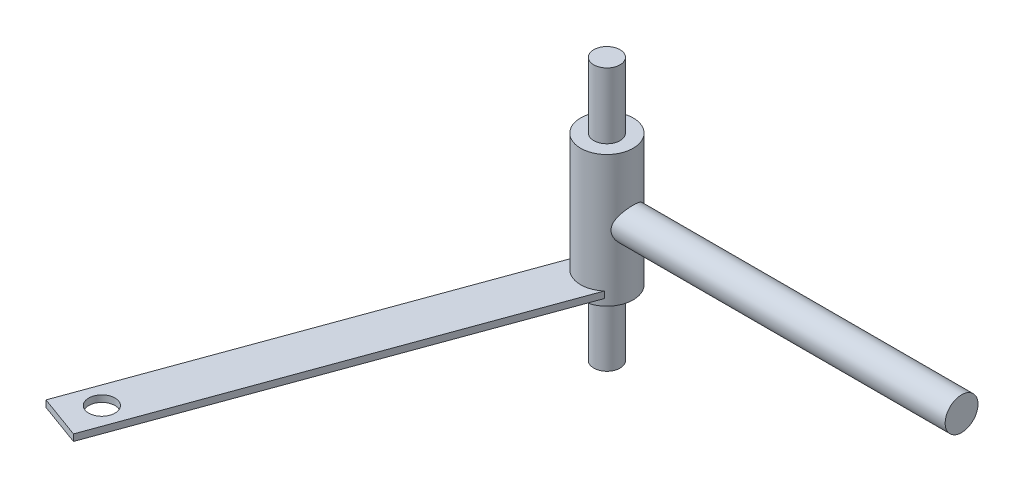
ISO-10303-21;
HEADER;
FILE_DESCRIPTION(('STEP AP214'),'2;1');
FILE_NAME('part.step','',(''),(''),'','','');
FILE_SCHEMA(('AUTOMOTIVE_DESIGN { 1 0 10303 214 1 1 1 1 }'));
ENDSEC;
DATA;
#1=APPLICATION_CONTEXT('core data for automotive mechanical design processes');
#2=APPLICATION_PROTOCOL_DEFINITION('international standard','automotive_design',2000,#1);
#3=PRODUCT_CONTEXT('',#1,'mechanical');
#4=PRODUCT('Part','Part','',(#3));
#5=PRODUCT_RELATED_PRODUCT_CATEGORY('part','',(#4));
#6=PRODUCT_DEFINITION_FORMATION('','',#4);
#7=PRODUCT_DEFINITION_CONTEXT('part definition',#1,'design');
#8=PRODUCT_DEFINITION('design','',#6,#7);
#9=PRODUCT_DEFINITION_SHAPE('','',#8);
#10=(LENGTH_UNIT() NAMED_UNIT(*) SI_UNIT(.MILLI.,.METRE.));
#11=(NAMED_UNIT(*) PLANE_ANGLE_UNIT() SI_UNIT($,.RADIAN.));
#12=(NAMED_UNIT(*) SI_UNIT($,.STERADIAN.) SOLID_ANGLE_UNIT());
#13=UNCERTAINTY_MEASURE_WITH_UNIT(LENGTH_MEASURE(1.E-05),#10,'distance_accuracy_value','');
#14=(GEOMETRIC_REPRESENTATION_CONTEXT(3) GLOBAL_UNCERTAINTY_ASSIGNED_CONTEXT((#13)) GLOBAL_UNIT_ASSIGNED_CONTEXT((#10,
#11,#12)) REPRESENTATION_CONTEXT('',''));
#15=CARTESIAN_POINT('',(0.,0.,0.));
#16=DIRECTION('',(0.,0.,1.));
#17=DIRECTION('',(1.,0.,0.));
#18=AXIS2_PLACEMENT_3D('',#15,#16,#17);
#19=CARTESIAN_POINT('',(0.,20.,0.));
#20=DIRECTION('',(0.,-1.,0.));
#21=DIRECTION('',(0.,0.,-1.));
#22=AXIS2_PLACEMENT_3D('',#19,#20,#21);
#23=CYLINDRICAL_SURFACE('',#22,8.);
#24=CARTESIAN_POINT('',(6.2449979983984,0.,5.));
#25=CARTESIAN_POINT('',(6.24499999083318,-0.124309997084916,4.99999874728376));
#26=CARTESIAN_POINT('',(6.24872594235153,-0.248643911922182,4.99535477639502));
#27=CARTESIAN_POINT('',(6.26346233698878,-0.49624234521784,4.97686385741702));
#28=CARTESIAN_POINT('',(6.27447707053879,-0.619506190474289,4.96301148892208));
#29=CARTESIAN_POINT('',(6.30332817855701,-0.864132894108489,4.92631685582622));
#30=CARTESIAN_POINT('',(6.32117831167981,-0.985491401070756,4.90345645667282));
#31=CARTESIAN_POINT('',(6.36295500797281,-1.22521846002732,4.84912073775945));
#32=CARTESIAN_POINT('',(6.38688460836052,-1.34358548492504,4.81764111134031));
#33=CARTESIAN_POINT('',(6.46598710467671,-1.69098285176997,4.7115563432738));
#34=CARTESIAN_POINT('',(6.52878844336903,-1.91472159134201,4.6249307188155));
#35=CARTESIAN_POINT('',(6.66732308206754,-2.34407629105235,4.42286683667302));
#36=CARTESIAN_POINT('',(6.74305673480881,-2.54969175663766,4.30742779304936));
#37=CARTESIAN_POINT('',(6.91118002626909,-2.9674414130167,4.03296948836377));
#38=CARTESIAN_POINT('',(7.00444112628932,-3.17674952950574,3.87018134056582));
#39=CARTESIAN_POINT('',(7.19012524520994,-3.5675602565304,3.51319765959103));
#40=CARTESIAN_POINT('',(7.28254746874407,-3.74903864049325,3.31897506071619));
#41=CARTESIAN_POINT('',(7.41988971846401,-4.00760626149244,2.99356128179164));
#42=CARTESIAN_POINT('',(7.46785190700925,-4.09554829341698,2.87212880091628));
#43=CARTESIAN_POINT('',(7.55971876275306,-4.2607595171728,2.62078661715024));
#44=CARTESIAN_POINT('',(7.60362512973126,-4.33803318685166,2.49088050482952));
#45=CARTESIAN_POINT('',(7.68611478127736,-4.48104536831486,2.22333771815377));
#46=CARTESIAN_POINT('',(7.72470066932016,-4.54678952615798,2.08570487145723));
#47=CARTESIAN_POINT('',(7.79539753077303,-4.66588913640084,1.80358193532003));
#48=CARTESIAN_POINT('',(7.82750968154027,-4.71924684175159,1.6590930986712));
#49=CARTESIAN_POINT('',(7.88132879110577,-4.8079574186921,1.37943032429723));
#50=CARTESIAN_POINT('',(7.90376135583819,-4.84458864196752,1.24480106420069));
#51=CARTESIAN_POINT('',(7.94191844310852,-4.90659427549434,0.972050692903698));
#52=CARTESIAN_POINT('',(7.95764407963578,-4.93197055516711,0.833930165626438));
#53=CARTESIAN_POINT('',(7.98191012055643,-4.97102838824165,0.555534462309618));
#54=CARTESIAN_POINT('',(7.9904564434862,-4.98471957483722,0.415261158337185));
#55=CARTESIAN_POINT('',(8.00011955525847,-5.00019508535282,0.133810084943768));
#56=CARTESIAN_POINT('',(8.00123719925945,-5.00198077978344,-0.00736757849820934));
#57=CARTESIAN_POINT('',(7.99636544353032,-4.99418306842006,-0.270239609899376));
#58=CARTESIAN_POINT('',(7.99131217584322,-4.9860972278415,-0.391999310072934));
#59=CARTESIAN_POINT('',(7.97573898833036,-4.96109950689231,-0.63429359230614));
#60=CARTESIAN_POINT('',(7.96521743178982,-4.94418498400023,-0.754827796543429));
#61=CARTESIAN_POINT('',(7.93894787928476,-4.90175195667388,-0.9937504162903));
#62=CARTESIAN_POINT('',(7.92320165200919,-4.8762363638823,-1.11213954368103));
#63=CARTESIAN_POINT('',(7.88683283084566,-4.81691536004192,-1.34607315554106));
#64=CARTESIAN_POINT('',(7.86620835217571,-4.78310674467799,-1.46161652141072));
#65=CARTESIAN_POINT('',(7.79753837345255,-4.66961406787293,-1.80341623892686));
#66=CARTESIAN_POINT('',(7.74273886956257,-4.57793007291278,-2.02447250488061));
#67=CARTESIAN_POINT('',(7.6194209119633,-4.36611560771666,-2.44811588786114));
#68=CARTESIAN_POINT('',(7.55089933332867,-4.24597865675437,-2.6506987826293));
#69=CARTESIAN_POINT('',(7.39573414184525,-3.96389668023518,-3.05883635403528));
#70=CARTESIAN_POINT('',(7.30789649394851,-3.79860933546551,-3.26162345770391));
#71=CARTESIAN_POINT('',(7.12780216070677,-3.43944259665051,-3.63842034253163));
#72=CARTESIAN_POINT('',(7.0355391870356,-3.24552165003414,-3.81238750882611));
#73=CARTESIAN_POINT('',(6.89398778931581,-2.92199806035766,-4.05999923159469));
#74=CARTESIAN_POINT('',(6.84343529038729,-2.80103153254676,-4.14440430037547));
#75=CARTESIAN_POINT('',(6.7450499014227,-2.5512511400869,-4.30267035241461));
#76=CARTESIAN_POINT('',(6.69721752335299,-2.42243580756731,-4.37652935467605));
#77=CARTESIAN_POINT('',(6.60608014442446,-2.15770926568204,-4.51291782494085));
#78=CARTESIAN_POINT('',(6.56276754252838,-2.02181056536115,-4.57546644816391));
#79=CARTESIAN_POINT('',(6.48238923774268,-1.74330768244433,-4.6886516739402));
#80=CARTESIAN_POINT('',(6.44532349757936,-1.60070353986484,-4.7392883475702));
#81=CARTESIAN_POINT('',(6.3879911088914,-1.34808415551627,-4.81614194168603));
#82=CARTESIAN_POINT('',(6.36587062744548,-1.23937010533179,-4.84527833481626));
#83=CARTESIAN_POINT('',(6.3267200135842,-1.01935900201234,-4.89628944573215));
#84=CARTESIAN_POINT('',(6.30968872571675,-0.908062541381968,-4.91816581196151));
#85=CARTESIAN_POINT('',(6.2813224765214,-0.683654493148006,-4.95434333722363));
#86=CARTESIAN_POINT('',(6.26998098512218,-0.570545140796211,-4.96865318123363));
#87=CARTESIAN_POINT('',(6.25339132178237,-0.343158274667134,-4.98951663397229));
#88=CARTESIAN_POINT('',(6.24814339794355,-0.228880713516906,-4.99606992689043));
#89=CARTESIAN_POINT('',(6.24394563972607,0.000213756327469843,-5.00131530513999));
#90=CARTESIAN_POINT('',(6.2450091194138,0.115031294285455,-4.99999077198392));
#91=CARTESIAN_POINT('',(6.25342323341975,0.34411058983996,-4.98946310366481));
#92=CARTESIAN_POINT('',(6.26077617711313,0.458372127783275,-4.98025707456074));
#93=CARTESIAN_POINT('',(6.28148941326477,0.685492435641885,-4.95410620951325));
#94=CARTESIAN_POINT('',(6.29485173090555,0.798350719467862,-4.9371587646522));
#95=CARTESIAN_POINT('',(6.32708655414446,1.02190368194708,-4.8957794498311));
#96=CARTESIAN_POINT('',(6.3459613393153,1.13259744525952,-4.87134448334739));
#97=CARTESIAN_POINT('',(6.40919739263554,1.45674114316006,-4.78821642821574));
#98=CARTESIAN_POINT('',(6.46057720915498,1.6662777271024,-4.71921780239627));
#99=CARTESIAN_POINT('',(6.57662484324882,2.07118631830434,-4.55609149726001));
#100=CARTESIAN_POINT('',(6.6412973751829,2.26655326684989,-4.46195489902188));
#101=CARTESIAN_POINT('',(6.79148506979738,2.67720575477837,-4.23062377482239));
#102=CARTESIAN_POINT('',(6.87862419429458,2.88920195195314,-4.08864375810928));
#103=CARTESIAN_POINT('',(7.05576916354209,3.28876845285956,-3.77473221644168));
#104=CARTESIAN_POINT('',(7.14577790264,3.47631305761312,-3.60276961587649));
#105=CARTESIAN_POINT('',(7.28444679190235,3.75109437385404,-3.30924585333197));
#106=CARTESIAN_POINT('',(7.3346230901993,3.84742308399405,-3.19677534649598));
#107=CARTESIAN_POINT('',(7.43214539316412,4.03023211498251,-2.96297696798608));
#108=CARTESIAN_POINT('',(7.47949245970999,4.11671614194503,-2.84165245789285));
#109=CARTESIAN_POINT('',(7.57009743381039,4.27912544276188,-2.59064393379972));
#110=CARTESIAN_POINT('',(7.61335451021155,4.35504857193848,-2.46095822963468));
#111=CARTESIAN_POINT('',(7.69452475176042,4.49544110368957,-2.19402109584822));
#112=CARTESIAN_POINT('',(7.73244126265916,4.55991768393769,-2.05677447863483));
#113=CARTESIAN_POINT('',(7.79976180045409,4.67313922374355,-1.78389488579443));
#114=CARTESIAN_POINT('',(7.82953658856128,4.72258893611767,-1.64864631402092));
#115=CARTESIAN_POINT('',(7.88249738910155,4.80988250173737,-1.37327166975237));
#116=CARTESIAN_POINT('',(7.90568721484267,4.84773307297854,-1.2331484731144));
#117=CARTESIAN_POINT('',(7.94476970960063,4.91121075887916,-0.949284871547718));
#118=CARTESIAN_POINT('',(7.96066874338032,4.93684853590452,-0.805547737630325));
#119=CARTESIAN_POINT('',(7.98468098207153,4.97547600812264,-0.515747890604359));
#120=CARTESIAN_POINT('',(7.99279547496114,4.98846779564148,-0.369685566273095));
#121=CARTESIAN_POINT('',(8.00036899836203,5.0005918204771,-0.0984542398463481));
#122=CARTESIAN_POINT('',(8.00093085905799,5.00148999709849,0.0266091901107878));
#123=CARTESIAN_POINT('',(7.99619997327325,4.99391869226614,0.276384426548502));
#124=CARTESIAN_POINT('',(7.99090543949389,4.98544635104714,0.401096114033592));
#125=CARTESIAN_POINT('',(7.97459103015405,4.95925462589747,0.649105048465708));
#126=CARTESIAN_POINT('',(7.96357367253312,4.9415393086947,0.772402893113274));
#127=CARTESIAN_POINT('',(7.93607401526798,4.89709863543925,1.01678782002796));
#128=CARTESIAN_POINT('',(7.91958960822669,4.87036980485838,1.13787403075122));
#129=CARTESIAN_POINT('',(7.88220417715129,4.80933512611737,1.3727696067634));
#130=CARTESIAN_POINT('',(7.86147899328625,4.77532902296419,1.486685097437));
#131=CARTESIAN_POINT('',(7.8157172820285,4.69961071566991,1.71105112688166));
#132=CARTESIAN_POINT('',(7.79067928081094,4.65789587685613,1.82150046585626));
#133=CARTESIAN_POINT('',(7.70981708144695,4.52179700785277,2.14674322952902));
#134=CARTESIAN_POINT('',(7.64821482975006,4.41641101660221,2.3556119089249));
#135=CARTESIAN_POINT('',(7.50700801995937,4.1673460340312,2.77466231937412));
#136=CARTESIAN_POINT('',(7.42619858107808,4.02082779517783,2.98273013480178));
#137=CARTESIAN_POINT('',(7.2573471375721,3.6996977630728,3.37285679634255));
#138=CARTESIAN_POINT('',(7.16929702745266,3.52505426989102,3.55488585185797));
#139=CARTESIAN_POINT('',(6.98001614835192,3.12352869133323,3.91489797533942));
#140=CARTESIAN_POINT('',(6.87871489286988,2.89274538552561,4.08851588919805));
#141=CARTESIAN_POINT('',(6.68699282488335,2.40144255795418,4.3950903074783));
#142=CARTESIAN_POINT('',(6.59656601160477,2.14093959230367,4.52806930044201));
#143=CARTESIAN_POINT('',(6.45719150743099,1.65432760274299,4.72397005512007));
#144=CARTESIAN_POINT('',(6.40349524541685,1.43325185965496,4.79586701428079));
#145=CARTESIAN_POINT('',(6.33898756748728,1.09324362690463,4.88041603953431));
#146=CARTESIAN_POINT('',(6.32016868842665,0.978627920072953,4.90470355408434));
#147=CARTESIAN_POINT('',(6.28849738412123,0.747193668970045,4.94524770814465));
#148=CARTESIAN_POINT('',(6.27564188891545,0.630376290428755,4.9615084801139));
#149=CARTESIAN_POINT('',(6.25906589814134,0.427895086979101,4.9823903295282));
#150=CARTESIAN_POINT('',(6.25380210027526,0.342553322442731,4.98898701036639));
#151=CARTESIAN_POINT('',(6.24676702410079,0.171478227136942,4.99779282932784));
#152=CARTESIAN_POINT('',(6.24499662408473,0.0857448033275004,5.00000086408101));
#153=CARTESIAN_POINT('',(6.2449979983984,0.,5.));
#154=B_SPLINE_CURVE_WITH_KNOTS('',3,(#24,#25,#26,#27,#28,#29,#30,#31,#32,#33,#34,#35,#36,#37,
#38,#39,#40,#41,#42,#43,#44,#45,#46,#47,#48,#49,#50,#51,#52,#53,#54,#55,#56,#57,#58,#59,#60,#61,
#62,#63,#64,#65,#66,#67,#68,#69,#70,#71,#72,#73,#74,#75,#76,#77,#78,#79,#80,#81,#82,#83,#84,#85,
#86,#87,#88,#89,#90,#91,#92,#93,#94,#95,#96,#97,#98,#99,#100,#101,#102,#103,#104,#105,#106,#107,
#108,#109,#110,#111,#112,#113,#114,#115,#116,#117,#118,#119,#120,#121,#122,#123,#124,#125,#126,
#127,#128,#129,#130,#131,#132,#133,#134,#135,#136,#137,#138,#139,#140,#141,#142,#143,#144,#145,
#146,#147,#148,#149,#150,#151,#152,#153),.UNSPECIFIED.,.T.,.F.,(4,2,2,2,2,2,2,2,2,2,2,2,2,2,2,2,
2,2,2,2,2,2,2,2,2,2,2,2,2,2,2,2,2,2,2,2,2,2,2,2,2,2,2,2,2,2,2,2,2,2,2,2,2,2,2,2,2,2,2,2,2,2,2,2,
4),(0.,0.372830631717394,0.745880919988992,1.11968608457865,1.49367836553752,2.2343739724708,
2.97508978546025,3.81517657771247,4.65599058786117,5.1276972709508,5.59920535801266,
6.0704818965238,6.54167264805615,6.9650003716167,7.38825775501684,7.8111658669397,
8.2340252946041,8.59998197802636,8.96604825916241,9.33199074341863,9.69807484639391,
10.4313641163756,11.1648205684642,11.9895533165928,12.8154948839412,13.2827866246025,
13.7501660272479,14.2167463086997,14.6833238060682,15.0271003394338,15.3707987622619,
15.7141018213498,16.0574188576537,16.4014603870609,16.7456282964257,17.0899122787371,
17.4343388350078,18.1111129623981,18.7881275281776,19.5940378131019,20.4007884080993,
20.8693475683427,21.337729748067,21.8062069071061,22.2743892571628,22.7148894158782,
23.1551339612148,23.5949934439159,24.0347801378503,24.409509228706,24.7843527137741,
25.1590314139736,25.5338547106938,25.8954875601863,26.2572442370256,26.9801965139639,
27.7781872367985,28.5770837508034,29.4911341692987,30.4046778558642,31.1173375632652,
31.472952845656,31.8283848529182,32.0854860972178,32.3426519723746),.UNSPECIFIED.);
#155=CARTESIAN_POINT('',(6.2449979983984,0.,5.));
#156=VERTEX_POINT('',#155);
#157=EDGE_CURVE('E137',#156,#156,#154,.T.);
#158=ORIENTED_EDGE('',*,*,#157,.F.);
#159=EDGE_LOOP('',(#158));
#160=FACE_BOUND('',#159,.T.);
#161=CARTESIAN_POINT('',(0.,-20.,0.));
#162=DIRECTION('',(0.,1.,0.));
#163=DIRECTION('',(0.,0.,1.));
#164=AXIS2_PLACEMENT_3D('',#161,#162,#163);
#165=CIRCLE('',#164,8.);
#166=CARTESIAN_POINT('',(0.,-20.,8.));
#167=VERTEX_POINT('',#166);
#168=EDGE_CURVE('E111',#167,#167,#165,.T.);
#169=ORIENTED_EDGE('',*,*,#168,.T.);
#170=EDGE_LOOP('',(#169));
#171=FACE_BOUND('',#170,.T.);
#172=CARTESIAN_POINT('',(0.,20.,0.));
#173=DIRECTION('',(0.,1.,0.));
#174=DIRECTION('',(0.,0.,1.));
#175=AXIS2_PLACEMENT_3D('',#172,#173,#174);
#176=CIRCLE('',#175,8.);
#177=CARTESIAN_POINT('',(0.,20.,8.));
#178=VERTEX_POINT('',#177);
#179=EDGE_CURVE('E117',#178,#178,#176,.T.);
#180=ORIENTED_EDGE('',*,*,#179,.F.);
#181=EDGE_LOOP('',(#180));
#182=FACE_BOUND('',#181,.T.);
#183=DIRECTION('',(0.,-1.,0.));
#184=VECTOR('',#183,1.);
#185=CARTESIAN_POINT('',(5.25321002633356,20.,6.03355487413751));
#186=LINE('',#185,#184);
#187=CARTESIAN_POINT('',(5.25321002633356,-18.,6.03355487413751));
#188=VERTEX_POINT('',#187);
#189=CARTESIAN_POINT('',(5.25321002633356,-16.,6.03355487413751));
#190=VERTEX_POINT('',#189);
#191=EDGE_CURVE('E11',#188,#190,#186,.F.);
#192=ORIENTED_EDGE('',*,*,#191,.F.);
#193=CARTESIAN_POINT('',(0.,-18.,0.));
#194=DIRECTION('',(0.,1.,0.));
#195=DIRECTION('',(0.,0.,1.));
#196=AXIS2_PLACEMENT_3D('',#193,#194,#195);
#197=CIRCLE('',#196,8.);
#198=CARTESIAN_POINT('',(-7.90248666466915,-18.,1.24527286757814));
#199=VERTEX_POINT('',#198);
#200=EDGE_CURVE('E149',#199,#188,#197,.T.);
#201=ORIENTED_EDGE('',*,*,#200,.F.);
#202=DIRECTION('',(0.,-1.,0.));
#203=VECTOR('',#202,1.);
#204=CARTESIAN_POINT('',(-7.90248666466915,20.,1.24527286757814));
#205=LINE('',#204,#203);
#206=CARTESIAN_POINT('',(-7.90248666466915,-16.,1.24527286757814));
#207=VERTEX_POINT('',#206);
#208=EDGE_CURVE('E62',#207,#199,#205,.T.);
#209=ORIENTED_EDGE('',*,*,#208,.F.);
#210=CARTESIAN_POINT('',(0.,-16.,0.));
#211=DIRECTION('',(0.,-1.,0.));
#212=DIRECTION('',(1.,0.,0.));
#213=AXIS2_PLACEMENT_3D('',#210,#211,#212);
#214=CIRCLE('',#213,8.);
#215=EDGE_CURVE('E52',#190,#207,#214,.T.);
#216=ORIENTED_EDGE('',*,*,#215,.F.);
#217=EDGE_LOOP('',(#192,#201,#209,#216));
#218=FACE_BOUND('',#217,.T.);
#219=ADVANCED_FACE('F43',(#160,#171,#182,#218),#23,.T.);
#220=CARTESIAN_POINT('',(0.,40.,0.));
#221=DIRECTION('',(0.,-1.,0.));
#222=DIRECTION('',(0.,0.,-1.));
#223=AXIS2_PLACEMENT_3D('',#220,#221,#222);
#224=CYLINDRICAL_SURFACE('',#223,4.);
#225=CARTESIAN_POINT('',(0.,20.,0.));
#226=DIRECTION('',(0.,1.,0.));
#227=DIRECTION('',(0.,0.,1.));
#228=AXIS2_PLACEMENT_3D('',#225,#226,#227);
#229=CIRCLE('',#228,4.);
#230=CARTESIAN_POINT('',(0.,20.,4.));
#231=VERTEX_POINT('',#230);
#232=EDGE_CURVE('E121',#231,#231,#229,.T.);
#233=ORIENTED_EDGE('',*,*,#232,.T.);
#234=EDGE_LOOP('',(#233));
#235=FACE_BOUND('',#234,.T.);
#236=CARTESIAN_POINT('',(0.,40.,0.));
#237=DIRECTION('',(0.,1.,0.));
#238=DIRECTION('',(0.,0.,1.));
#239=AXIS2_PLACEMENT_3D('',#236,#237,#238);
#240=CIRCLE('',#239,4.);
#241=CARTESIAN_POINT('',(0.,40.,4.));
#242=VERTEX_POINT('',#241);
#243=EDGE_CURVE('E125',#242,#242,#240,.T.);
#244=ORIENTED_EDGE('',*,*,#243,.F.);
#245=EDGE_LOOP('',(#244));
#246=FACE_BOUND('',#245,.T.);
#247=ADVANCED_FACE('F45',(#235,#246),#224,.T.);
#248=CARTESIAN_POINT('',(0.,40.,0.));
#249=DIRECTION('',(0.,1.,0.));
#250=DIRECTION('',(0.,0.,1.));
#251=AXIS2_PLACEMENT_3D('',#248,#249,#250);
#252=PLANE('',#251);
#253=ORIENTED_EDGE('',*,*,#243,.T.);
#254=EDGE_LOOP('',(#253));
#255=FACE_BOUND('',#254,.T.);
#256=ADVANCED_FACE('F166',(#255),#252,.T.);
#257=CARTESIAN_POINT('',(0.,20.,0.));
#258=DIRECTION('',(0.,1.,0.));
#259=DIRECTION('',(0.,0.,1.));
#260=AXIS2_PLACEMENT_3D('',#257,#258,#259);
#261=PLANE('',#260);
#262=ORIENTED_EDGE('',*,*,#232,.F.);
#263=EDGE_LOOP('',(#262));
#264=FACE_BOUND('',#263,.T.);
#265=ORIENTED_EDGE('',*,*,#179,.T.);
#266=EDGE_LOOP('',(#265));
#267=FACE_BOUND('',#266,.T.);
#268=ADVANCED_FACE('F163',(#264,#267),#261,.T.);
#269=CARTESIAN_POINT('',(0.,-20.,0.));
#270=DIRECTION('',(0.,1.,0.));
#271=DIRECTION('',(0.,0.,1.));
#272=AXIS2_PLACEMENT_3D('',#269,#270,#271);
#273=PLANE('',#272);
#274=CARTESIAN_POINT('',(0.,-20.,0.));
#275=DIRECTION('',(0.,1.,0.));
#276=DIRECTION('',(0.,0.,1.));
#277=AXIS2_PLACEMENT_3D('',#274,#275,#276);
#278=CIRCLE('',#277,4.);
#279=CARTESIAN_POINT('',(0.,-20.,4.));
#280=VERTEX_POINT('',#279);
#281=EDGE_CURVE('E129',#280,#280,#278,.T.);
#282=ORIENTED_EDGE('',*,*,#281,.T.);
#283=EDGE_LOOP('',(#282));
#284=FACE_BOUND('',#283,.T.);
#285=ORIENTED_EDGE('',*,*,#168,.F.);
#286=EDGE_LOOP('',(#285));
#287=FACE_BOUND('',#286,.T.);
#288=ADVANCED_FACE('F165',(#284,#287),#273,.F.);
#289=CARTESIAN_POINT('',(0.,-40.,0.));
#290=DIRECTION('',(0.,1.,0.));
#291=DIRECTION('',(0.,0.,1.));
#292=AXIS2_PLACEMENT_3D('',#289,#290,#291);
#293=PLANE('',#292);
#294=CARTESIAN_POINT('',(0.,-40.,0.));
#295=DIRECTION('',(0.,1.,0.));
#296=DIRECTION('',(0.,0.,1.));
#297=AXIS2_PLACEMENT_3D('',#294,#295,#296);
#298=CIRCLE('',#297,4.);
#299=CARTESIAN_POINT('',(0.,-40.,4.));
#300=VERTEX_POINT('',#299);
#301=EDGE_CURVE('E130',#300,#300,#298,.T.);
#302=ORIENTED_EDGE('',*,*,#301,.F.);
#303=EDGE_LOOP('',(#302));
#304=FACE_BOUND('',#303,.T.);
#305=ADVANCED_FACE('F169',(#304),#293,.F.);
#306=ORIENTED_EDGE('',*,*,#301,.T.);
#307=EDGE_LOOP('',(#306));
#308=FACE_BOUND('',#307,.T.);
#309=ORIENTED_EDGE('',*,*,#281,.F.);
#310=EDGE_LOOP('',(#309));
#311=FACE_BOUND('',#310,.T.);
#312=ADVANCED_FACE('F160',(#308,#311),#224,.T.);
#313=CARTESIAN_POINT('',(108.,0.,0.));
#314=DIRECTION('',(-1.,0.,0.));
#315=DIRECTION('',(0.,0.,1.));
#316=AXIS2_PLACEMENT_3D('',#313,#314,#315);
#317=CYLINDRICAL_SURFACE('',#316,5.);
#318=CARTESIAN_POINT('',(108.,0.,0.));
#319=DIRECTION('',(1.,0.,0.));
#320=DIRECTION('',(0.,0.,-1.));
#321=AXIS2_PLACEMENT_3D('',#318,#319,#320);
#322=CIRCLE('',#321,5.);
#323=CARTESIAN_POINT('',(108.,0.,-5.));
#324=VERTEX_POINT('',#323);
#325=EDGE_CURVE('E106',#324,#324,#322,.T.);
#326=ORIENTED_EDGE('',*,*,#325,.F.);
#327=EDGE_LOOP('',(#326));
#328=FACE_BOUND('',#327,.T.);
#329=ORIENTED_EDGE('',*,*,#157,.T.);
#330=EDGE_LOOP('',(#329));
#331=FACE_BOUND('',#330,.T.);
#332=ADVANCED_FACE('F154',(#328,#331),#317,.T.);
#333=CARTESIAN_POINT('',(108.,0.,0.));
#334=DIRECTION('',(1.,0.,0.));
#335=DIRECTION('',(0.,0.,-1.));
#336=AXIS2_PLACEMENT_3D('',#333,#334,#335);
#337=PLANE('',#336);
#338=ORIENTED_EDGE('',*,*,#325,.T.);
#339=EDGE_LOOP('',(#338));
#340=FACE_BOUND('',#339,.T.);
#341=ADVANCED_FACE('F159',(#340),#337,.T.);
#342=CARTESIAN_POINT('',(-37.8847702868357,-16.,124.554181705448));
#343=DIRECTION('',(-0.939692620785908,0.,-0.34202014332567));
#344=DIRECTION('',(-0.34202014332567,0.,0.939692620785908));
#345=AXIS2_PLACEMENT_3D('',#342,#343,#344);
#346=PLANE('',#345);
#347=DIRECTION('',(0.34202014332567,0.,-0.939692620785908));
#348=VECTOR('',#347,1.);
#349=CARTESIAN_POINT('',(-37.8847702868357,-18.,124.554181705448));
#350=LINE('',#349,#348);
#351=CARTESIAN_POINT('',(-37.8847702868357,-18.,124.554181705448));
#352=VERTEX_POINT('',#351);
#353=EDGE_CURVE('E191',#352,#188,#350,.T.);
#354=ORIENTED_EDGE('',*,*,#353,.T.);
#355=ORIENTED_EDGE('',*,*,#191,.T.);
#356=DIRECTION('',(0.34202014332567,0.,-0.939692620785908));
#357=VECTOR('',#356,1.);
#358=CARTESIAN_POINT('',(-37.8847702868357,-16.,124.554181705448));
#359=LINE('',#358,#357);
#360=CARTESIAN_POINT('',(-37.8847702868357,-16.,124.554181705448));
#361=VERTEX_POINT('',#360);
#362=EDGE_CURVE('E85',#361,#190,#359,.T.);
#363=ORIENTED_EDGE('',*,*,#362,.F.);
#364=DIRECTION('',(0.,1.,0.));
#365=VECTOR('',#364,1.);
#366=CARTESIAN_POINT('',(-37.8847702868357,-16.,124.554181705448));
#367=LINE('',#366,#365);
#368=EDGE_CURVE('E92',#352,#361,#367,.T.);
#369=ORIENTED_EDGE('',*,*,#368,.F.);
#370=EDGE_LOOP('',(#354,#355,#363,#369));
#371=FACE_BOUND('',#370,.T.);
#372=ADVANCED_FACE('F104',(#371),#346,.F.);
#373=CARTESIAN_POINT('',(-51.0404669778384,-16.,119.765899698888));
#374=DIRECTION('',(0.939692620785908,0.,0.34202014332567));
#375=DIRECTION('',(0.34202014332567,0.,-0.939692620785908));
#376=AXIS2_PLACEMENT_3D('',#373,#374,#375);
#377=PLANE('',#376);
#378=DIRECTION('',(0.34202014332567,0.,-0.939692620785908));
#379=VECTOR('',#378,1.);
#380=CARTESIAN_POINT('',(-51.0404669778384,-16.,119.765899698888));
#381=LINE('',#380,#379);
#382=CARTESIAN_POINT('',(-51.0404669778384,-16.,119.765899698888));
#383=VERTEX_POINT('',#382);
#384=EDGE_CURVE('E87',#383,#207,#381,.T.);
#385=ORIENTED_EDGE('',*,*,#384,.T.);
#386=ORIENTED_EDGE('',*,*,#208,.T.);
#387=DIRECTION('',(0.34202014332567,0.,-0.939692620785908));
#388=VECTOR('',#387,1.);
#389=CARTESIAN_POINT('',(-51.0404669778384,-18.,119.765899698888));
#390=LINE('',#389,#388);
#391=CARTESIAN_POINT('',(-51.0404669778384,-18.,119.765899698888));
#392=VERTEX_POINT('',#391);
#393=EDGE_CURVE('E113',#392,#199,#390,.T.);
#394=ORIENTED_EDGE('',*,*,#393,.F.);
#395=DIRECTION('',(0.,-1.,0.));
#396=VECTOR('',#395,1.);
#397=CARTESIAN_POINT('',(-51.0404669778384,-16.,119.765899698888));
#398=LINE('',#397,#396);
#399=EDGE_CURVE('E91',#383,#392,#398,.T.);
#400=ORIENTED_EDGE('',*,*,#399,.F.);
#401=EDGE_LOOP('',(#385,#386,#394,#400));
#402=FACE_BOUND('',#401,.T.);
#403=ADVANCED_FACE('F214',(#402),#377,.F.);
#404=CARTESIAN_POINT('',(-51.0404669778384,-16.,119.765899698888));
#405=DIRECTION('',(0.,-1.,0.));
#406=DIRECTION('',(1.,0.,0.));
#407=AXIS2_PLACEMENT_3D('',#404,#405,#406);
#408=PLANE('',#407);
#409=CARTESIAN_POINT('',(-41.0424171990804,-16.,112.763114494309));
#410=DIRECTION('',(0.,1.,0.));
#411=DIRECTION('',(-1.,0.,0.));
#412=AXIS2_PLACEMENT_3D('',#409,#410,#411);
#413=CIRCLE('',#412,4.00000000000001);
#414=CARTESIAN_POINT('',(-45.0424171990804,-16.,112.763114494309));
#415=VERTEX_POINT('',#414);
#416=EDGE_CURVE('E205',#415,#415,#413,.T.);
#417=ORIENTED_EDGE('',*,*,#416,.F.);
#418=EDGE_LOOP('',(#417));
#419=FACE_BOUND('',#418,.T.);
#420=ORIENTED_EDGE('',*,*,#362,.T.);
#421=ORIENTED_EDGE('',*,*,#215,.T.);
#422=ORIENTED_EDGE('',*,*,#384,.F.);
#423=DIRECTION('',(-0.939692620785908,0.,-0.34202014332567));
#424=VECTOR('',#423,1.);
#425=CARTESIAN_POINT('',(-51.0404669778384,-16.,119.765899698888));
#426=LINE('',#425,#424);
#427=EDGE_CURVE('E81',#361,#383,#426,.T.);
#428=ORIENTED_EDGE('',*,*,#427,.F.);
#429=EDGE_LOOP('',(#420,#421,#422,#428));
#430=FACE_BOUND('',#429,.T.);
#431=ADVANCED_FACE('F83',(#419,#430),#408,.F.);
#432=CARTESIAN_POINT('',(-51.0404669778384,-18.,119.765899698888));
#433=DIRECTION('',(0.,1.,0.));
#434=DIRECTION('',(0.,0.,1.));
#435=AXIS2_PLACEMENT_3D('',#432,#433,#434);
#436=PLANE('',#435);
#437=CARTESIAN_POINT('',(-41.0424171990804,-18.,112.763114494309));
#438=DIRECTION('',(0.,1.,0.));
#439=DIRECTION('',(0.,0.,1.));
#440=AXIS2_PLACEMENT_3D('',#437,#438,#439);
#441=CIRCLE('',#440,4.00000000000001);
#442=CARTESIAN_POINT('',(-41.0424171990804,-18.,116.763114494309));
#443=VERTEX_POINT('',#442);
#444=EDGE_CURVE('E102',#443,#443,#441,.F.);
#445=ORIENTED_EDGE('',*,*,#444,.F.);
#446=EDGE_LOOP('',(#445));
#447=FACE_BOUND('',#446,.T.);
#448=ORIENTED_EDGE('',*,*,#393,.T.);
#449=ORIENTED_EDGE('',*,*,#200,.T.);
#450=ORIENTED_EDGE('',*,*,#353,.F.);
#451=DIRECTION('',(0.939692620785908,0.,0.34202014332567));
#452=VECTOR('',#451,1.);
#453=CARTESIAN_POINT('',(-51.0404669778384,-18.,119.765899698888));
#454=LINE('',#453,#452);
#455=EDGE_CURVE('E97',#392,#352,#454,.T.);
#456=ORIENTED_EDGE('',*,*,#455,.F.);
#457=EDGE_LOOP('',(#448,#449,#450,#456));
#458=FACE_BOUND('',#457,.T.);
#459=ADVANCED_FACE('F190',(#447,#458),#436,.F.);
#460=CARTESIAN_POINT('',(-44.4626186323371,0.,122.160040702168));
#461=DIRECTION('',(-0.34202014332567,0.,0.939692620785908));
#462=DIRECTION('',(0.939692620785908,0.,0.34202014332567));
#463=AXIS2_PLACEMENT_3D('',#460,#461,#462);
#464=PLANE('',#463);
#465=ORIENTED_EDGE('',*,*,#368,.T.);
#466=ORIENTED_EDGE('',*,*,#427,.T.);
#467=ORIENTED_EDGE('',*,*,#399,.T.);
#468=ORIENTED_EDGE('',*,*,#455,.T.);
#469=EDGE_LOOP('',(#465,#466,#467,#468));
#470=FACE_BOUND('',#469,.T.);
#471=ADVANCED_FACE('F95',(#470),#464,.T.);
#472=CARTESIAN_POINT('',(-41.0424171990804,-40.001,112.763114494309));
#473=DIRECTION('',(0.,1.,0.));
#474=DIRECTION('',(-1.,0.,0.));
#475=AXIS2_PLACEMENT_3D('',#472,#473,#474);
#476=CYLINDRICAL_SURFACE('',#475,4.00000000000001);
#477=ORIENTED_EDGE('',*,*,#416,.T.);
#478=EDGE_LOOP('',(#477));
#479=FACE_BOUND('',#478,.T.);
#480=ORIENTED_EDGE('',*,*,#444,.T.);
#481=EDGE_LOOP('',(#480));
#482=FACE_BOUND('',#481,.T.);
#483=ADVANCED_FACE('F210',(#479,#482),#476,.F.);
#484=CLOSED_SHELL('',(#219,#247,#256,#268,#288,#305,#312,#332,#341,#372,#403,#431,#459,#471,#483));
#485=MANIFOLD_SOLID_BREP('B2',#484);
#486=ADVANCED_BREP_SHAPE_REPRESENTATION('',(#18,#485),#14);
#487=SHAPE_DEFINITION_REPRESENTATION(#9,#486);
ENDSEC;
END-ISO-10303-21;
